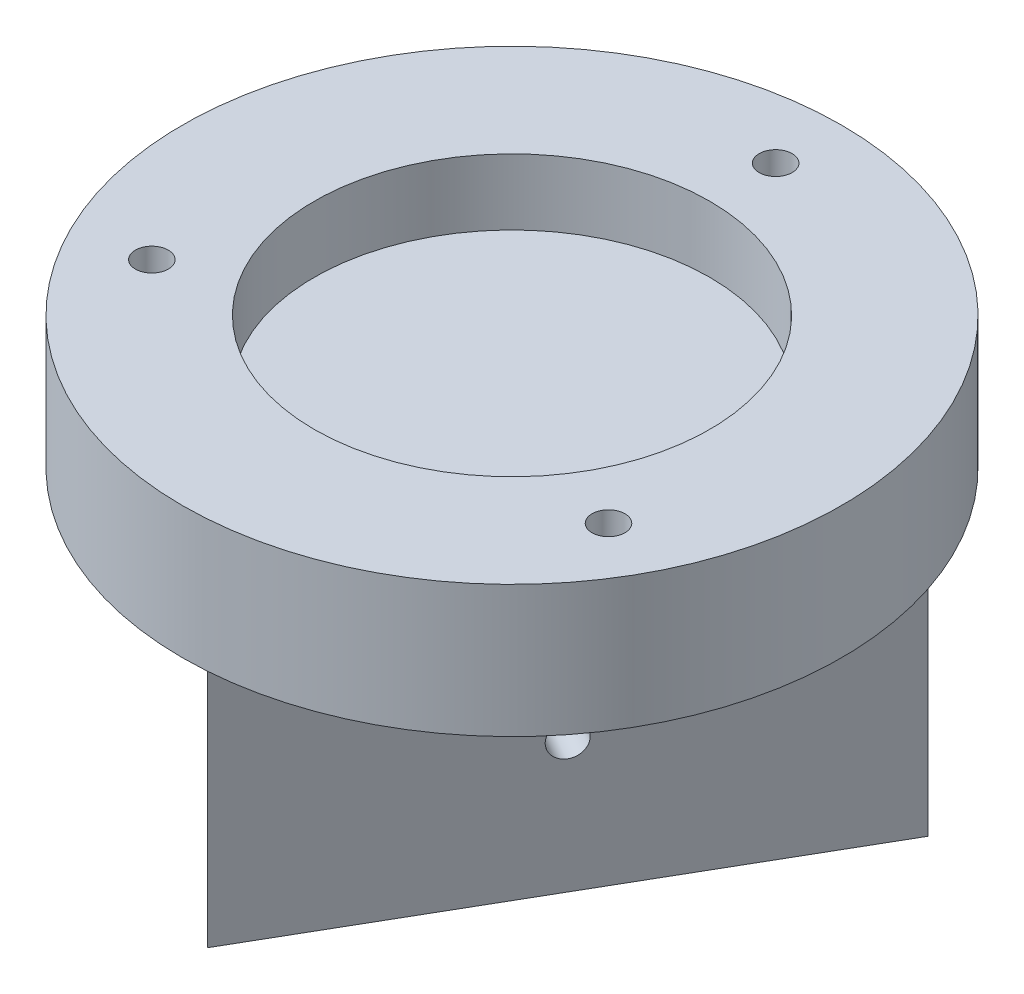
ISO-10303-21;
HEADER;
FILE_DESCRIPTION(('STEP AP214'),'2;1');
FILE_NAME('part.step','',(''),(''),'','','');
FILE_SCHEMA(('AUTOMOTIVE_DESIGN { 1 0 10303 214 1 1 1 1 }'));
ENDSEC;
DATA;
#1=APPLICATION_CONTEXT('core data for automotive mechanical design processes');
#2=APPLICATION_PROTOCOL_DEFINITION('international standard','automotive_design',2000,#1);
#3=PRODUCT_CONTEXT('',#1,'mechanical');
#4=PRODUCT('Part','Part','',(#3));
#5=PRODUCT_RELATED_PRODUCT_CATEGORY('part','',(#4));
#6=PRODUCT_DEFINITION_FORMATION('','',#4);
#7=PRODUCT_DEFINITION_CONTEXT('part definition',#1,'design');
#8=PRODUCT_DEFINITION('design','',#6,#7);
#9=PRODUCT_DEFINITION_SHAPE('','',#8);
#10=(LENGTH_UNIT() NAMED_UNIT(*) SI_UNIT(.MILLI.,.METRE.));
#11=(NAMED_UNIT(*) PLANE_ANGLE_UNIT() SI_UNIT($,.RADIAN.));
#12=(NAMED_UNIT(*) SI_UNIT($,.STERADIAN.) SOLID_ANGLE_UNIT());
#13=UNCERTAINTY_MEASURE_WITH_UNIT(LENGTH_MEASURE(1.E-05),#10,'distance_accuracy_value','');
#14=(GEOMETRIC_REPRESENTATION_CONTEXT(3) GLOBAL_UNCERTAINTY_ASSIGNED_CONTEXT((#13)) GLOBAL_UNIT_ASSIGNED_CONTEXT((#10,
#11,#12)) REPRESENTATION_CONTEXT('',''));
#15=CARTESIAN_POINT('',(0.,0.,0.));
#16=DIRECTION('',(0.,0.,1.));
#17=DIRECTION('',(1.,0.,0.));
#18=AXIS2_PLACEMENT_3D('',#15,#16,#17);
#19=CARTESIAN_POINT('',(0.,0.,0.));
#20=DIRECTION('',(0.,1.,0.));
#21=DIRECTION('',(0.,0.,1.));
#22=AXIS2_PLACEMENT_3D('',#19,#20,#21);
#23=PLANE('',#22);
#24=CARTESIAN_POINT('',(0.,0.,-50.8000000000006));
#25=DIRECTION('',(0.,1.,0.));
#26=DIRECTION('',(0.,0.,1.));
#27=AXIS2_PLACEMENT_3D('',#24,#25,#26);
#28=CIRCLE('',#27,3.17499999999984);
#29=CARTESIAN_POINT('',(0.,0.,-47.6250000000008));
#30=VERTEX_POINT('',#29);
#31=EDGE_CURVE('E124',#30,#30,#28,.T.);
#32=ORIENTED_EDGE('',*,*,#31,.T.);
#33=EDGE_LOOP('',(#32));
#34=FACE_BOUND('',#33,.T.);
#35=CARTESIAN_POINT('',(43.9940905122507,0.,25.4000000000003));
#36=DIRECTION('',(0.,1.,0.));
#37=DIRECTION('',(0.,0.,1.));
#38=AXIS2_PLACEMENT_3D('',#35,#36,#37);
#39=CIRCLE('',#38,3.17499999999625);
#40=CARTESIAN_POINT('',(43.9940905122507,0.,28.5749999999966));
#41=VERTEX_POINT('',#40);
#42=EDGE_CURVE('E111',#41,#41,#39,.T.);
#43=ORIENTED_EDGE('',*,*,#42,.T.);
#44=EDGE_LOOP('',(#43));
#45=FACE_BOUND('',#44,.T.);
#46=CARTESIAN_POINT('',(-43.9940905122507,0.,25.4000000000003));
#47=DIRECTION('',(0.,1.,0.));
#48=DIRECTION('',(0.,0.,1.));
#49=AXIS2_PLACEMENT_3D('',#46,#47,#48);
#50=CIRCLE('',#49,3.17499999999907);
#51=CARTESIAN_POINT('',(-43.9940905122507,0.,28.5749999999994));
#52=VERTEX_POINT('',#51);
#53=EDGE_CURVE('E107',#52,#52,#50,.T.);
#54=ORIENTED_EDGE('',*,*,#53,.T.);
#55=EDGE_LOOP('',(#54));
#56=FACE_BOUND('',#55,.T.);
#57=CARTESIAN_POINT('',(0.,0.,0.));
#58=DIRECTION('',(0.,1.,0.));
#59=DIRECTION('',(0.,0.,1.));
#60=AXIS2_PLACEMENT_3D('',#57,#58,#59);
#61=CIRCLE('',#60,63.4999999999994);
#62=CARTESIAN_POINT('',(0.,0.,63.4999999999994));
#63=VERTEX_POINT('',#62);
#64=EDGE_CURVE('E46',#63,#63,#61,.T.);
#65=ORIENTED_EDGE('',*,*,#64,.F.);
#66=EDGE_LOOP('',(#65));
#67=FACE_BOUND('',#66,.T.);
#68=DIRECTION('',(1.,0.,0.));
#69=VECTOR('',#68,1.);
#70=CARTESIAN_POINT('',(-50.8,0.,-29.3293936748329));
#71=LINE('',#70,#69);
#72=CARTESIAN_POINT('',(-50.8,0.,-29.3293936748329));
#73=VERTEX_POINT('',#72);
#74=CARTESIAN_POINT('',(50.7999999999998,0.,-29.329393674833));
#75=VERTEX_POINT('',#74);
#76=EDGE_CURVE('E54',#73,#75,#71,.T.);
#77=ORIENTED_EDGE('',*,*,#76,.F.);
#78=DIRECTION('',(-0.5,0.,-0.866025403784439));
#79=VECTOR('',#78,1.);
#80=CARTESIAN_POINT('',(0.,0.,58.658787349666));
#81=LINE('',#80,#79);
#82=CARTESIAN_POINT('',(0.,0.,58.658787349666));
#83=VERTEX_POINT('',#82);
#84=EDGE_CURVE('E89',#83,#73,#81,.T.);
#85=ORIENTED_EDGE('',*,*,#84,.F.);
#86=DIRECTION('',(-0.499999999999999,0.,0.866025403784439));
#87=VECTOR('',#86,1.);
#88=CARTESIAN_POINT('',(50.7999999999998,0.,-29.329393674833));
#89=LINE('',#88,#87);
#90=EDGE_CURVE('E58',#75,#83,#89,.T.);
#91=ORIENTED_EDGE('',*,*,#90,.F.);
#92=EDGE_LOOP('',(#77,#85,#91));
#93=FACE_BOUND('',#92,.T.);
#94=ADVANCED_FACE('F37',(#34,#45,#56,#67,#93),#23,.F.);
#95=CARTESIAN_POINT('',(0.,25.4,0.));
#96=DIRECTION('',(0.,-1.,0.));
#97=DIRECTION('',(0.,0.,-1.));
#98=AXIS2_PLACEMENT_3D('',#95,#96,#97);
#99=CYLINDRICAL_SURFACE('',#98,63.4999999999994);
#100=CARTESIAN_POINT('',(0.,25.4,0.));
#101=DIRECTION('',(0.,1.,0.));
#102=DIRECTION('',(0.,0.,1.));
#103=AXIS2_PLACEMENT_3D('',#100,#101,#102);
#104=CIRCLE('',#103,63.4999999999994);
#105=CARTESIAN_POINT('',(0.,25.4,63.4999999999994));
#106=VERTEX_POINT('',#105);
#107=EDGE_CURVE('E11',#106,#106,#104,.T.);
#108=ORIENTED_EDGE('',*,*,#107,.F.);
#109=EDGE_LOOP('',(#108));
#110=FACE_BOUND('',#109,.T.);
#111=ORIENTED_EDGE('',*,*,#64,.T.);
#112=EDGE_LOOP('',(#111));
#113=FACE_BOUND('',#112,.T.);
#114=ADVANCED_FACE('F39',(#110,#113),#99,.T.);
#115=CARTESIAN_POINT('',(0.,25.4,0.));
#116=DIRECTION('',(0.,1.,0.));
#117=DIRECTION('',(0.,0.,1.));
#118=AXIS2_PLACEMENT_3D('',#115,#116,#117);
#119=PLANE('',#118);
#120=CARTESIAN_POINT('',(0.,25.4,-50.8000000000006));
#121=DIRECTION('',(0.,1.,0.));
#122=DIRECTION('',(0.,0.,1.));
#123=AXIS2_PLACEMENT_3D('',#120,#121,#122);
#124=CIRCLE('',#123,3.17499999999984);
#125=CARTESIAN_POINT('',(0.,25.4,-47.6250000000008));
#126=VERTEX_POINT('',#125);
#127=EDGE_CURVE('E41',#126,#126,#124,.T.);
#128=ORIENTED_EDGE('',*,*,#127,.F.);
#129=EDGE_LOOP('',(#128));
#130=FACE_BOUND('',#129,.T.);
#131=CARTESIAN_POINT('',(43.9940905122507,25.4,25.4000000000003));
#132=DIRECTION('',(0.,1.,0.));
#133=DIRECTION('',(0.,0.,1.));
#134=AXIS2_PLACEMENT_3D('',#131,#132,#133);
#135=CIRCLE('',#134,3.17499999999625);
#136=CARTESIAN_POINT('',(43.9940905122507,25.4,28.5749999999966));
#137=VERTEX_POINT('',#136);
#138=EDGE_CURVE('E109',#137,#137,#135,.T.);
#139=ORIENTED_EDGE('',*,*,#138,.F.);
#140=EDGE_LOOP('',(#139));
#141=FACE_BOUND('',#140,.T.);
#142=CARTESIAN_POINT('',(-43.9940905122507,25.4,25.4000000000003));
#143=DIRECTION('',(0.,1.,0.));
#144=DIRECTION('',(0.,0.,1.));
#145=AXIS2_PLACEMENT_3D('',#142,#143,#144);
#146=CIRCLE('',#145,3.17499999999907);
#147=CARTESIAN_POINT('',(-43.9940905122507,25.4,28.5749999999994));
#148=VERTEX_POINT('',#147);
#149=EDGE_CURVE('E105',#148,#148,#146,.T.);
#150=ORIENTED_EDGE('',*,*,#149,.F.);
#151=EDGE_LOOP('',(#150));
#152=FACE_BOUND('',#151,.T.);
#153=CARTESIAN_POINT('',(0.,25.4,0.));
#154=DIRECTION('',(0.,1.,0.));
#155=DIRECTION('',(0.,0.,1.));
#156=AXIS2_PLACEMENT_3D('',#153,#154,#155);
#157=CIRCLE('',#156,38.1);
#158=CARTESIAN_POINT('',(0.,25.4,38.1));
#159=VERTEX_POINT('',#158);
#160=EDGE_CURVE('E92',#159,#159,#157,.T.);
#161=ORIENTED_EDGE('',*,*,#160,.F.);
#162=EDGE_LOOP('',(#161));
#163=FACE_BOUND('',#162,.T.);
#164=ORIENTED_EDGE('',*,*,#107,.T.);
#165=EDGE_LOOP('',(#164));
#166=FACE_BOUND('',#165,.T.);
#167=ADVANCED_FACE('F137',(#130,#141,#152,#163,#166),#119,.T.);
#168=CARTESIAN_POINT('',(0.,12.7,0.));
#169=DIRECTION('',(0.,1.,0.));
#170=DIRECTION('',(0.,0.,1.));
#171=AXIS2_PLACEMENT_3D('',#168,#169,#170);
#172=CYLINDRICAL_SURFACE('',#171,38.1);
#173=CARTESIAN_POINT('',(0.,12.7,0.));
#174=DIRECTION('',(0.,1.,0.));
#175=DIRECTION('',(0.,0.,1.));
#176=AXIS2_PLACEMENT_3D('',#173,#174,#175);
#177=CIRCLE('',#176,38.1);
#178=CARTESIAN_POINT('',(0.,12.7,38.1));
#179=VERTEX_POINT('',#178);
#180=EDGE_CURVE('E95',#179,#179,#177,.T.);
#181=ORIENTED_EDGE('',*,*,#180,.F.);
#182=EDGE_LOOP('',(#181));
#183=FACE_BOUND('',#182,.T.);
#184=ORIENTED_EDGE('',*,*,#160,.T.);
#185=EDGE_LOOP('',(#184));
#186=FACE_BOUND('',#185,.T.);
#187=ADVANCED_FACE('F143',(#183,#186),#172,.F.);
#188=CARTESIAN_POINT('',(0.,12.7,0.));
#189=DIRECTION('',(0.,1.,0.));
#190=DIRECTION('',(0.,0.,1.));
#191=AXIS2_PLACEMENT_3D('',#188,#189,#190);
#192=PLANE('',#191);
#193=ORIENTED_EDGE('',*,*,#180,.T.);
#194=EDGE_LOOP('',(#193));
#195=FACE_BOUND('',#194,.T.);
#196=ADVANCED_FACE('F147',(#195),#192,.T.);
#197=CARTESIAN_POINT('',(-50.8,-50.8,-29.3293936748329));
#198=DIRECTION('',(0.,0.,1.));
#199=DIRECTION('',(1.,0.,0.));
#200=AXIS2_PLACEMENT_3D('',#197,#198,#199);
#201=PLANE('',#200);
#202=CARTESIAN_POINT('',(0.,-25.4,-29.329393674833));
#203=DIRECTION('',(0.,0.,1.));
#204=DIRECTION('',(1.,0.,0.));
#205=AXIS2_PLACEMENT_3D('',#202,#203,#204);
#206=CIRCLE('',#205,3.175);
#207=CARTESIAN_POINT('',(3.17499999999994,-25.4,-29.329393674833));
#208=VERTEX_POINT('',#207);
#209=EDGE_CURVE('E202',#208,#208,#206,.T.);
#210=ORIENTED_EDGE('',*,*,#209,.T.);
#211=EDGE_LOOP('',(#210));
#212=FACE_BOUND('',#211,.T.);
#213=ORIENTED_EDGE('',*,*,#76,.T.);
#214=DIRECTION('',(0.,1.,0.));
#215=VECTOR('',#214,1.);
#216=CARTESIAN_POINT('',(50.7999999999998,-50.8,-29.329393674833));
#217=LINE('',#216,#215);
#218=CARTESIAN_POINT('',(50.7999999999998,-50.8,-29.329393674833));
#219=VERTEX_POINT('',#218);
#220=EDGE_CURVE('E76',#219,#75,#217,.T.);
#221=ORIENTED_EDGE('',*,*,#220,.F.);
#222=DIRECTION('',(1.,0.,0.));
#223=VECTOR('',#222,1.);
#224=CARTESIAN_POINT('',(-50.8,-50.8,-29.3293936748329));
#225=LINE('',#224,#223);
#226=CARTESIAN_POINT('',(-50.8,-50.8,-29.3293936748329));
#227=VERTEX_POINT('',#226);
#228=EDGE_CURVE('E82',#227,#219,#225,.T.);
#229=ORIENTED_EDGE('',*,*,#228,.F.);
#230=DIRECTION('',(0.,1.,0.));
#231=VECTOR('',#230,1.);
#232=CARTESIAN_POINT('',(-50.8,-50.8,-29.3293936748329));
#233=LINE('',#232,#231);
#234=EDGE_CURVE('E97',#227,#73,#233,.T.);
#235=ORIENTED_EDGE('',*,*,#234,.T.);
#236=EDGE_LOOP('',(#213,#221,#229,#235));
#237=FACE_BOUND('',#236,.T.);
#238=ADVANCED_FACE('F91',(#212,#237),#201,.F.);
#239=CARTESIAN_POINT('',(50.7999999999998,-50.8,-29.329393674833));
#240=DIRECTION('',(-0.866025403784439,0.,-0.499999999999999));
#241=DIRECTION('',(-0.499999999999999,0.,0.86602540378444));
#242=AXIS2_PLACEMENT_3D('',#239,#240,#241);
#243=PLANE('',#242);
#244=CARTESIAN_POINT('',(25.4,-25.4,14.6646968374164));
#245=DIRECTION('',(0.866025403784439,0.,0.5));
#246=DIRECTION('',(0.5,0.,-0.866025403784439));
#247=AXIS2_PLACEMENT_3D('',#244,#245,#246);
#248=CIRCLE('',#247,3.175);
#249=CARTESIAN_POINT('',(26.9875,-25.4,11.9150661804008));
#250=VERTEX_POINT('',#249);
#251=EDGE_CURVE('E203',#250,#250,#248,.T.);
#252=ORIENTED_EDGE('',*,*,#251,.F.);
#253=EDGE_LOOP('',(#252));
#254=FACE_BOUND('',#253,.T.);
#255=ORIENTED_EDGE('',*,*,#90,.T.);
#256=DIRECTION('',(0.,1.,0.));
#257=VECTOR('',#256,1.);
#258=CARTESIAN_POINT('',(0.,-50.8,58.658787349666));
#259=LINE('',#258,#257);
#260=CARTESIAN_POINT('',(0.,-50.8,58.658787349666));
#261=VERTEX_POINT('',#260);
#262=EDGE_CURVE('E78',#261,#83,#259,.T.);
#263=ORIENTED_EDGE('',*,*,#262,.F.);
#264=DIRECTION('',(-0.499999999999999,0.,0.866025403784439));
#265=VECTOR('',#264,1.);
#266=CARTESIAN_POINT('',(50.7999999999998,-50.8,-29.329393674833));
#267=LINE('',#266,#265);
#268=EDGE_CURVE('E72',#219,#261,#267,.T.);
#269=ORIENTED_EDGE('',*,*,#268,.F.);
#270=ORIENTED_EDGE('',*,*,#220,.T.);
#271=EDGE_LOOP('',(#255,#263,#269,#270));
#272=FACE_BOUND('',#271,.T.);
#273=ADVANCED_FACE('F74',(#254,#272),#243,.F.);
#274=CARTESIAN_POINT('',(0.,-50.8,58.658787349666));
#275=DIRECTION('',(0.866025403784439,0.,-0.5));
#276=DIRECTION('',(-0.5,0.,-0.866025403784439));
#277=AXIS2_PLACEMENT_3D('',#274,#275,#276);
#278=PLANE('',#277);
#279=CARTESIAN_POINT('',(-25.4,-25.4,14.6646968374165));
#280=DIRECTION('',(-0.866025403784439,0.,0.5));
#281=DIRECTION('',(0.5,0.,0.866025403784439));
#282=AXIS2_PLACEMENT_3D('',#279,#280,#281);
#283=CIRCLE('',#282,3.175);
#284=CARTESIAN_POINT('',(-23.8125,-25.4,17.4143274944321));
#285=VERTEX_POINT('',#284);
#286=EDGE_CURVE('E121',#285,#285,#283,.T.);
#287=ORIENTED_EDGE('',*,*,#286,.F.);
#288=EDGE_LOOP('',(#287));
#289=FACE_BOUND('',#288,.T.);
#290=ORIENTED_EDGE('',*,*,#84,.T.);
#291=ORIENTED_EDGE('',*,*,#234,.F.);
#292=DIRECTION('',(-0.5,0.,-0.866025403784439));
#293=VECTOR('',#292,1.);
#294=CARTESIAN_POINT('',(0.,-50.8,58.658787349666));
#295=LINE('',#294,#293);
#296=EDGE_CURVE('E81',#261,#227,#295,.T.);
#297=ORIENTED_EDGE('',*,*,#296,.F.);
#298=ORIENTED_EDGE('',*,*,#262,.T.);
#299=EDGE_LOOP('',(#290,#291,#297,#298));
#300=FACE_BOUND('',#299,.T.);
#301=ADVANCED_FACE('F131',(#289,#300),#278,.F.);
#302=CARTESIAN_POINT('',(0.,-50.8,0.));
#303=DIRECTION('',(0.,-1.,0.));
#304=DIRECTION('',(0.,0.,-1.));
#305=AXIS2_PLACEMENT_3D('',#302,#303,#304);
#306=PLANE('',#305);
#307=ORIENTED_EDGE('',*,*,#228,.T.);
#308=ORIENTED_EDGE('',*,*,#268,.T.);
#309=ORIENTED_EDGE('',*,*,#296,.T.);
#310=EDGE_LOOP('',(#307,#308,#309));
#311=FACE_BOUND('',#310,.T.);
#312=ADVANCED_FACE('F85',(#311),#306,.T.);
#313=CARTESIAN_POINT('',(-43.9940905122507,-50.8,25.4000000000003));
#314=DIRECTION('',(0.,1.,0.));
#315=DIRECTION('',(0.,0.,1.));
#316=AXIS2_PLACEMENT_3D('',#313,#314,#315);
#317=CYLINDRICAL_SURFACE('',#316,3.17499999999907);
#318=ORIENTED_EDGE('',*,*,#149,.T.);
#319=EDGE_LOOP('',(#318));
#320=FACE_BOUND('',#319,.T.);
#321=ORIENTED_EDGE('',*,*,#53,.F.);
#322=EDGE_LOOP('',(#321));
#323=FACE_BOUND('',#322,.T.);
#324=ADVANCED_FACE('F163',(#320,#323),#317,.F.);
#325=CARTESIAN_POINT('',(43.9940905122507,-50.8,25.4000000000003));
#326=DIRECTION('',(0.,1.,0.));
#327=DIRECTION('',(0.,0.,1.));
#328=AXIS2_PLACEMENT_3D('',#325,#326,#327);
#329=CYLINDRICAL_SURFACE('',#328,3.17499999999625);
#330=ORIENTED_EDGE('',*,*,#138,.T.);
#331=EDGE_LOOP('',(#330));
#332=FACE_BOUND('',#331,.T.);
#333=ORIENTED_EDGE('',*,*,#42,.F.);
#334=EDGE_LOOP('',(#333));
#335=FACE_BOUND('',#334,.T.);
#336=ADVANCED_FACE('F166',(#332,#335),#329,.F.);
#337=CARTESIAN_POINT('',(0.,-50.8,-50.8000000000006));
#338=DIRECTION('',(0.,1.,0.));
#339=DIRECTION('',(0.,0.,1.));
#340=AXIS2_PLACEMENT_3D('',#337,#338,#339);
#341=CYLINDRICAL_SURFACE('',#340,3.17499999999984);
#342=ORIENTED_EDGE('',*,*,#127,.T.);
#343=EDGE_LOOP('',(#342));
#344=FACE_BOUND('',#343,.T.);
#345=ORIENTED_EDGE('',*,*,#31,.F.);
#346=EDGE_LOOP('',(#345));
#347=FACE_BOUND('',#346,.T.);
#348=ADVANCED_FACE('F170',(#344,#347),#341,.F.);
#349=CARTESIAN_POINT('',(-12.2017728463252,-25.4,7.04469683741649));
#350=DIRECTION('',(-0.866025403784439,0.,0.5));
#351=DIRECTION('',(0.5,0.,0.866025403784439));
#352=AXIS2_PLACEMENT_3D('',#349,#350,#351);
#353=CYLINDRICAL_SURFACE('',#352,3.175);
#354=CARTESIAN_POINT('',(-12.2017728463252,-25.4,7.04469683741649));
#355=DIRECTION('',(-0.866025403784439,0.,0.5));
#356=DIRECTION('',(0.5,0.,0.866025403784439));
#357=AXIS2_PLACEMENT_3D('',#354,#355,#356);
#358=CIRCLE('',#357,3.175);
#359=CARTESIAN_POINT('',(-10.6142728463252,-25.4,9.79432749443208));
#360=VERTEX_POINT('',#359);
#361=EDGE_CURVE('E108',#360,#360,#358,.T.);
#362=ORIENTED_EDGE('',*,*,#361,.F.);
#363=EDGE_LOOP('',(#362));
#364=FACE_BOUND('',#363,.T.);
#365=ORIENTED_EDGE('',*,*,#286,.T.);
#366=EDGE_LOOP('',(#365));
#367=FACE_BOUND('',#366,.T.);
#368=ADVANCED_FACE('F173',(#364,#367),#353,.F.);
#369=CARTESIAN_POINT('',(-12.2017728463252,-25.4,7.04469683741649));
#370=DIRECTION('',(-0.866025403784439,0.,0.5));
#371=DIRECTION('',(0.5,0.,0.866025403784439));
#372=AXIS2_PLACEMENT_3D('',#369,#370,#371);
#373=PLANE('',#372);
#374=ORIENTED_EDGE('',*,*,#361,.T.);
#375=EDGE_LOOP('',(#374));
#376=FACE_BOUND('',#375,.T.);
#377=ADVANCED_FACE('F177',(#376),#373,.T.);
#378=CARTESIAN_POINT('',(0.,-25.4,-14.0893936748329));
#379=DIRECTION('',(0.,0.,-1.));
#380=DIRECTION('',(-1.,0.,0.));
#381=AXIS2_PLACEMENT_3D('',#378,#379,#380);
#382=CYLINDRICAL_SURFACE('',#381,3.175);
#383=CARTESIAN_POINT('',(0.,-25.4,-14.0893936748329));
#384=DIRECTION('',(0.,0.,1.));
#385=DIRECTION('',(1.,0.,0.));
#386=AXIS2_PLACEMENT_3D('',#383,#384,#385);
#387=CIRCLE('',#386,3.175);
#388=CARTESIAN_POINT('',(3.17499999999994,-25.4,-14.0893936748329));
#389=VERTEX_POINT('',#388);
#390=EDGE_CURVE('E206',#389,#389,#387,.T.);
#391=ORIENTED_EDGE('',*,*,#390,.T.);
#392=EDGE_LOOP('',(#391));
#393=FACE_BOUND('',#392,.T.);
#394=ORIENTED_EDGE('',*,*,#209,.F.);
#395=EDGE_LOOP('',(#394));
#396=FACE_BOUND('',#395,.T.);
#397=ADVANCED_FACE('F181',(#393,#396),#382,.F.);
#398=CARTESIAN_POINT('',(0.,-25.4,-14.0893936748329));
#399=DIRECTION('',(0.,0.,1.));
#400=DIRECTION('',(1.,0.,0.));
#401=AXIS2_PLACEMENT_3D('',#398,#399,#400);
#402=PLANE('',#401);
#403=ORIENTED_EDGE('',*,*,#390,.F.);
#404=EDGE_LOOP('',(#403));
#405=FACE_BOUND('',#404,.T.);
#406=ADVANCED_FACE('F185',(#405),#402,.F.);
#407=CARTESIAN_POINT('',(12.2017728463251,-25.4,7.04469683741644));
#408=DIRECTION('',(0.866025403784439,0.,0.5));
#409=DIRECTION('',(0.5,0.,-0.866025403784439));
#410=AXIS2_PLACEMENT_3D('',#407,#408,#409);
#411=CYLINDRICAL_SURFACE('',#410,3.175);
#412=CARTESIAN_POINT('',(12.2017728463251,-25.4,7.04469683741644));
#413=DIRECTION('',(0.866025403784439,0.,0.5));
#414=DIRECTION('',(0.5,0.,-0.866025403784439));
#415=AXIS2_PLACEMENT_3D('',#412,#413,#414);
#416=CIRCLE('',#415,3.175);
#417=CARTESIAN_POINT('',(13.7892728463251,-25.4,4.29506618040085));
#418=VERTEX_POINT('',#417);
#419=EDGE_CURVE('E201',#418,#418,#416,.T.);
#420=ORIENTED_EDGE('',*,*,#419,.F.);
#421=EDGE_LOOP('',(#420));
#422=FACE_BOUND('',#421,.T.);
#423=ORIENTED_EDGE('',*,*,#251,.T.);
#424=EDGE_LOOP('',(#423));
#425=FACE_BOUND('',#424,.T.);
#426=ADVANCED_FACE('F189',(#422,#425),#411,.F.);
#427=CARTESIAN_POINT('',(12.2017728463251,-25.4,7.04469683741644));
#428=DIRECTION('',(0.866025403784439,0.,0.5));
#429=DIRECTION('',(0.5,0.,-0.866025403784439));
#430=AXIS2_PLACEMENT_3D('',#427,#428,#429);
#431=PLANE('',#430);
#432=ORIENTED_EDGE('',*,*,#419,.T.);
#433=EDGE_LOOP('',(#432));
#434=FACE_BOUND('',#433,.T.);
#435=ADVANCED_FACE('F193',(#434),#431,.T.);
#436=CLOSED_SHELL('',(#94,#114,#167,#187,#196,#238,#273,#301,#312,#324,#336,#348,#368,#377,#397,
#406,#426,#435));
#437=MANIFOLD_SOLID_BREP('B2',#436);
#438=ADVANCED_BREP_SHAPE_REPRESENTATION('',(#18,#437),#14);
#439=SHAPE_DEFINITION_REPRESENTATION(#9,#438);
ENDSEC;
END-ISO-10303-21;
